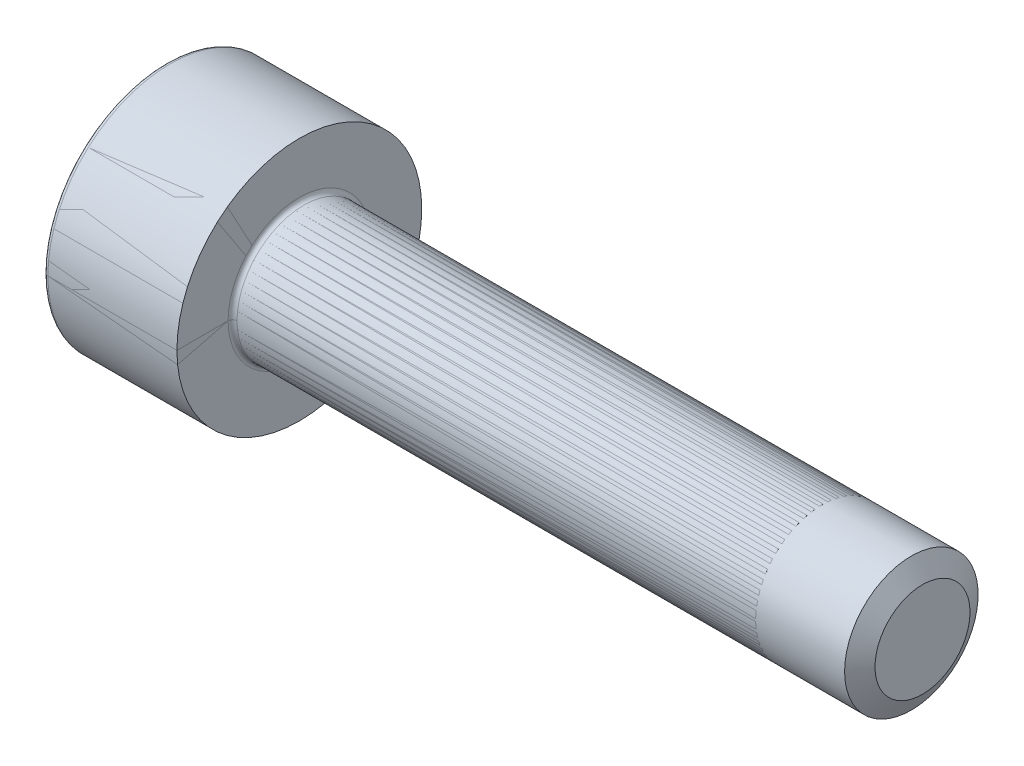
ISO-10303-21;
HEADER;
FILE_DESCRIPTION(('STEP AP214'),'2;1');
FILE_NAME('part.step','',(''),(''),'','','');
FILE_SCHEMA(('AUTOMOTIVE_DESIGN { 1 0 10303 214 1 1 1 1 }'));
ENDSEC;
DATA;
#1=APPLICATION_CONTEXT('core data for automotive mechanical design processes');
#2=APPLICATION_PROTOCOL_DEFINITION('international standard','automotive_design',2000,#1);
#3=PRODUCT_CONTEXT('',#1,'mechanical');
#4=PRODUCT('Part','Part','',(#3));
#5=PRODUCT_RELATED_PRODUCT_CATEGORY('part','',(#4));
#6=PRODUCT_DEFINITION_FORMATION('','',#4);
#7=PRODUCT_DEFINITION_CONTEXT('part definition',#1,'design');
#8=PRODUCT_DEFINITION('design','',#6,#7);
#9=PRODUCT_DEFINITION_SHAPE('','',#8);
#10=(LENGTH_UNIT() NAMED_UNIT(*) SI_UNIT(.MILLI.,.METRE.));
#11=(NAMED_UNIT(*) PLANE_ANGLE_UNIT() SI_UNIT($,.RADIAN.));
#12=(NAMED_UNIT(*) SI_UNIT($,.STERADIAN.) SOLID_ANGLE_UNIT());
#13=UNCERTAINTY_MEASURE_WITH_UNIT(LENGTH_MEASURE(1.E-05),#10,'distance_accuracy_value','');
#14=(GEOMETRIC_REPRESENTATION_CONTEXT(3) GLOBAL_UNCERTAINTY_ASSIGNED_CONTEXT((#13)) GLOBAL_UNIT_ASSIGNED_CONTEXT((#10,
#11,#12)) REPRESENTATION_CONTEXT('',''));
#15=CARTESIAN_POINT('',(0.,0.,0.));
#16=DIRECTION('',(0.,0.,1.));
#17=DIRECTION('',(1.,0.,0.));
#18=AXIS2_PLACEMENT_3D('',#15,#16,#17);
#19=CARTESIAN_POINT('',(0.1,0.,0.));
#20=DIRECTION('',(-1.,0.,0.));
#21=DIRECTION('',(0.,0.,1.));
#22=AXIS2_PLACEMENT_3D('',#19,#20,#21);
#23=TOROIDAL_SURFACE('',#22,2.65,0.1);
#24=CARTESIAN_POINT('',(0.1,0.,-2.65));
#25=DIRECTION('',(0.,1.,0.));
#26=DIRECTION('',(0.,0.,1.));
#27=AXIS2_PLACEMENT_3D('',#24,#25,#26);
#28=CIRCLE('',#27,0.1);
#29=CARTESIAN_POINT('',(0.1,0.,-2.75));
#30=VERTEX_POINT('',#29);
#31=CARTESIAN_POINT('',(0.,0.,-2.65));
#32=VERTEX_POINT('',#31);
#33=EDGE_CURVE('P0_E199',#30,#32,#28,.T.);
#34=ORIENTED_EDGE('',*,*,#33,.F.);
#35=CARTESIAN_POINT('',(0.1,0.,0.));
#36=DIRECTION('',(1.,0.,0.));
#37=DIRECTION('',(0.,0.,1.));
#38=AXIS2_PLACEMENT_3D('',#35,#36,#37);
#39=CIRCLE('',#38,2.75);
#40=CARTESIAN_POINT('',(0.1,0.,2.75));
#41=VERTEX_POINT('',#40);
#42=EDGE_CURVE('P0_E203',#41,#30,#39,.T.);
#43=ORIENTED_EDGE('',*,*,#42,.F.);
#44=CARTESIAN_POINT('',(0.1,0.,2.65));
#45=DIRECTION('',(0.,-1.,0.));
#46=DIRECTION('',(0.,0.,-1.));
#47=AXIS2_PLACEMENT_3D('',#44,#45,#46);
#48=CIRCLE('',#47,0.1);
#49=CARTESIAN_POINT('',(0.,0.,2.65));
#50=VERTEX_POINT('',#49);
#51=EDGE_CURVE('P0_E195',#41,#50,#48,.T.);
#52=ORIENTED_EDGE('',*,*,#51,.T.);
#53=CARTESIAN_POINT('',(0.,0.,0.));
#54=DIRECTION('',(-1.,0.,0.));
#55=DIRECTION('',(0.,0.,1.));
#56=AXIS2_PLACEMENT_3D('',#53,#54,#55);
#57=CIRCLE('',#56,2.65);
#58=EDGE_CURVE('P0_E221',#32,#50,#57,.T.);
#59=ORIENTED_EDGE('',*,*,#58,.F.);
#60=EDGE_LOOP('',(#34,#43,#52,#59));
#61=FACE_BOUND('',#60,.T.);
#62=ADVANCED_FACE('P0_F36',(#61),#23,.T.);
#63=CARTESIAN_POINT('',(1.3,-0.7175,1.24274645443067));
#64=DIRECTION('',(-1.,0.,0.));
#65=DIRECTION('',(0.,0.,1.));
#66=AXIS2_PLACEMENT_3D('',#63,#64,#65);
#67=PLANE('',#66);
#68=DIRECTION('',(0.,0.5,0.866025403784439));
#69=VECTOR('',#68,1.);
#70=CARTESIAN_POINT('',(1.3,-1.435,0.));
#71=LINE('',#70,#69);
#72=CARTESIAN_POINT('',(1.3,-1.435,0.));
#73=VERTEX_POINT('',#72);
#74=CARTESIAN_POINT('',(1.3,-0.7175,1.24274645443067));
#75=VERTEX_POINT('',#74);
#76=EDGE_CURVE('P0_E142',#73,#75,#71,.T.);
#77=ORIENTED_EDGE('',*,*,#76,.T.);
#78=DIRECTION('',(0.,1.,0.));
#79=VECTOR('',#78,1.);
#80=CARTESIAN_POINT('',(1.3,-0.7175,1.24274645443067));
#81=LINE('',#80,#79);
#82=CARTESIAN_POINT('',(1.3,0.7175,1.24274645443067));
#83=VERTEX_POINT('',#82);
#84=EDGE_CURVE('P0_E11',#75,#83,#81,.T.);
#85=ORIENTED_EDGE('',*,*,#84,.T.);
#86=DIRECTION('',(0.,0.5,-0.866025403784439));
#87=VECTOR('',#86,1.);
#88=CARTESIAN_POINT('',(1.3,0.7175,1.24274645443067));
#89=LINE('',#88,#87);
#90=CARTESIAN_POINT('',(1.3,1.435,0.));
#91=VERTEX_POINT('',#90);
#92=EDGE_CURVE('P0_E258',#83,#91,#89,.T.);
#93=ORIENTED_EDGE('',*,*,#92,.T.);
#94=DIRECTION('',(0.,-0.5,-0.866025403784439));
#95=VECTOR('',#94,1.);
#96=CARTESIAN_POINT('',(1.3,1.435,0.));
#97=LINE('',#96,#95);
#98=CARTESIAN_POINT('',(1.3,0.7175,-1.24274645443067));
#99=VERTEX_POINT('',#98);
#100=EDGE_CURVE('P0_E250',#91,#99,#97,.T.);
#101=ORIENTED_EDGE('',*,*,#100,.T.);
#102=DIRECTION('',(0.,-1.,0.));
#103=VECTOR('',#102,1.);
#104=CARTESIAN_POINT('',(1.3,0.7175,-1.24274645443067));
#105=LINE('',#104,#103);
#106=CARTESIAN_POINT('',(1.3,-0.7175,-1.24274645443067));
#107=VERTEX_POINT('',#106);
#108=EDGE_CURVE('P0_E254',#99,#107,#105,.T.);
#109=ORIENTED_EDGE('',*,*,#108,.T.);
#110=DIRECTION('',(0.,-0.5,0.866025403784439));
#111=VECTOR('',#110,1.);
#112=CARTESIAN_POINT('',(1.3,-0.7175,-1.24274645443067));
#113=LINE('',#112,#111);
#114=EDGE_CURVE('P0_E145',#107,#73,#113,.T.);
#115=ORIENTED_EDGE('',*,*,#114,.T.);
#116=EDGE_LOOP('',(#77,#85,#93,#101,#109,#115));
#117=FACE_BOUND('',#116,.T.);
#118=ADVANCED_FACE('P0_F143',(#117),#67,.T.);
#119=CARTESIAN_POINT('',(1.3,-0.7175,1.24274645443067));
#120=DIRECTION('',(0.,0.,1.));
#121=DIRECTION('',(0.,-1.,0.));
#122=AXIS2_PLACEMENT_3D('',#119,#120,#121);
#123=PLANE('',#122);
#124=DIRECTION('',(0.,1.,0.));
#125=VECTOR('',#124,1.);
#126=CARTESIAN_POINT('',(0.,-0.7175,1.24274645443067));
#127=LINE('',#126,#125);
#128=CARTESIAN_POINT('',(0.,-0.7175,1.24274645443067));
#129=VERTEX_POINT('',#128);
#130=CARTESIAN_POINT('',(0.,0.7175,1.24274645443067));
#131=VERTEX_POINT('',#130);
#132=EDGE_CURVE('P0_E209',#129,#131,#127,.T.);
#133=ORIENTED_EDGE('',*,*,#132,.T.);
#134=DIRECTION('',(-1.,0.,0.));
#135=VECTOR('',#134,1.);
#136=CARTESIAN_POINT('',(1.3,0.7175,1.24274645443067));
#137=LINE('',#136,#135);
#138=EDGE_CURVE('P0_E47',#83,#131,#137,.T.);
#139=ORIENTED_EDGE('',*,*,#138,.F.);
#140=ORIENTED_EDGE('',*,*,#84,.F.);
#141=DIRECTION('',(-1.,0.,0.));
#142=VECTOR('',#141,1.);
#143=CARTESIAN_POINT('',(1.3,-0.7175,1.24274645443067));
#144=LINE('',#143,#142);
#145=EDGE_CURVE('P0_E139',#75,#129,#144,.T.);
#146=ORIENTED_EDGE('',*,*,#145,.T.);
#147=EDGE_LOOP('',(#133,#139,#140,#146));
#148=FACE_BOUND('',#147,.T.);
#149=ADVANCED_FACE('P0_F38',(#148),#123,.F.);
#150=CARTESIAN_POINT('',(1.3,0.7175,1.24274645443067));
#151=DIRECTION('',(0.,0.866025403784439,0.5));
#152=DIRECTION('',(1.,0.,0.));
#153=AXIS2_PLACEMENT_3D('',#150,#151,#152);
#154=PLANE('',#153);
#155=DIRECTION('',(0.,0.5,-0.866025403784439));
#156=VECTOR('',#155,1.);
#157=CARTESIAN_POINT('',(0.,0.7175,1.24274645443067));
#158=LINE('',#157,#156);
#159=CARTESIAN_POINT('',(0.,1.435,0.));
#160=VERTEX_POINT('',#159);
#161=EDGE_CURVE('P0_E218',#131,#160,#158,.T.);
#162=ORIENTED_EDGE('',*,*,#161,.T.);
#163=DIRECTION('',(-1.,0.,0.));
#164=VECTOR('',#163,1.);
#165=CARTESIAN_POINT('',(1.3,1.435,0.));
#166=LINE('',#165,#164);
#167=EDGE_CURVE('P0_E255',#91,#160,#166,.T.);
#168=ORIENTED_EDGE('',*,*,#167,.F.);
#169=ORIENTED_EDGE('',*,*,#92,.F.);
#170=ORIENTED_EDGE('',*,*,#138,.T.);
#171=EDGE_LOOP('',(#162,#168,#169,#170));
#172=FACE_BOUND('',#171,.T.);
#173=ADVANCED_FACE('P0_F375',(#172),#154,.F.);
#174=CARTESIAN_POINT('',(1.3,1.435,0.));
#175=DIRECTION('',(0.,0.866025403784439,-0.5));
#176=DIRECTION('',(-1.,0.,0.));
#177=AXIS2_PLACEMENT_3D('',#174,#175,#176);
#178=PLANE('',#177);
#179=DIRECTION('',(0.,-0.5,-0.866025403784439));
#180=VECTOR('',#179,1.);
#181=CARTESIAN_POINT('',(0.,1.435,0.));
#182=LINE('',#181,#180);
#183=CARTESIAN_POINT('',(0.,0.7175,-1.24274645443067));
#184=VERTEX_POINT('',#183);
#185=EDGE_CURVE('P0_E271',#160,#184,#182,.T.);
#186=ORIENTED_EDGE('',*,*,#185,.T.);
#187=DIRECTION('',(-1.,0.,0.));
#188=VECTOR('',#187,1.);
#189=CARTESIAN_POINT('',(1.3,0.7175,-1.24274645443067));
#190=LINE('',#189,#188);
#191=EDGE_CURVE('P0_E252',#99,#184,#190,.T.);
#192=ORIENTED_EDGE('',*,*,#191,.F.);
#193=ORIENTED_EDGE('',*,*,#100,.F.);
#194=ORIENTED_EDGE('',*,*,#167,.T.);
#195=EDGE_LOOP('',(#186,#192,#193,#194));
#196=FACE_BOUND('',#195,.T.);
#197=ADVANCED_FACE('P0_F377',(#196),#178,.F.);
#198=CARTESIAN_POINT('',(1.3,0.7175,-1.24274645443067));
#199=DIRECTION('',(0.,0.,-1.));
#200=DIRECTION('',(0.,-1.,0.));
#201=AXIS2_PLACEMENT_3D('',#198,#199,#200);
#202=PLANE('',#201);
#203=DIRECTION('',(0.,-1.,0.));
#204=VECTOR('',#203,1.);
#205=CARTESIAN_POINT('',(0.,0.7175,-1.24274645443067));
#206=LINE('',#205,#204);
#207=CARTESIAN_POINT('',(0.,-0.7175,-1.24274645443067));
#208=VERTEX_POINT('',#207);
#209=EDGE_CURVE('P0_E274',#184,#208,#206,.T.);
#210=ORIENTED_EDGE('',*,*,#209,.T.);
#211=DIRECTION('',(-1.,0.,0.));
#212=VECTOR('',#211,1.);
#213=CARTESIAN_POINT('',(1.3,-0.7175,-1.24274645443067));
#214=LINE('',#213,#212);
#215=EDGE_CURVE('P0_E169',#107,#208,#214,.T.);
#216=ORIENTED_EDGE('',*,*,#215,.F.);
#217=ORIENTED_EDGE('',*,*,#108,.F.);
#218=ORIENTED_EDGE('',*,*,#191,.T.);
#219=EDGE_LOOP('',(#210,#216,#217,#218));
#220=FACE_BOUND('',#219,.T.);
#221=ADVANCED_FACE('P0_F382',(#220),#202,.F.);
#222=CARTESIAN_POINT('',(1.3,-0.7175,-1.24274645443067));
#223=DIRECTION('',(0.,-0.866025403784439,-0.5));
#224=DIRECTION('',(0.,0.5,-0.866025403784439));
#225=AXIS2_PLACEMENT_3D('',#222,#223,#224);
#226=PLANE('',#225);
#227=DIRECTION('',(0.,-0.5,0.866025403784439));
#228=VECTOR('',#227,1.);
#229=CARTESIAN_POINT('',(0.,-0.7175,-1.24274645443067));
#230=LINE('',#229,#228);
#231=CARTESIAN_POINT('',(0.,-1.435,0.));
#232=VERTEX_POINT('',#231);
#233=EDGE_CURVE('P0_E40',#208,#232,#230,.T.);
#234=ORIENTED_EDGE('',*,*,#233,.T.);
#235=DIRECTION('',(-1.,0.,0.));
#236=VECTOR('',#235,1.);
#237=CARTESIAN_POINT('',(1.3,-1.435,0.));
#238=LINE('',#237,#236);
#239=EDGE_CURVE('P0_E150',#73,#232,#238,.T.);
#240=ORIENTED_EDGE('',*,*,#239,.F.);
#241=ORIENTED_EDGE('',*,*,#114,.F.);
#242=ORIENTED_EDGE('',*,*,#215,.T.);
#243=EDGE_LOOP('',(#234,#240,#241,#242));
#244=FACE_BOUND('',#243,.T.);
#245=ADVANCED_FACE('P0_F348',(#244),#226,.F.);
#246=CARTESIAN_POINT('',(1.3,-1.435,0.));
#247=DIRECTION('',(0.,-0.866025403784439,0.5));
#248=DIRECTION('',(-1.,0.,0.));
#249=AXIS2_PLACEMENT_3D('',#246,#247,#248);
#250=PLANE('',#249);
#251=DIRECTION('',(0.,0.5,0.866025403784439));
#252=VECTOR('',#251,1.);
#253=CARTESIAN_POINT('',(0.,-1.435,0.));
#254=LINE('',#253,#252);
#255=EDGE_CURVE('P0_E155',#232,#129,#254,.T.);
#256=ORIENTED_EDGE('',*,*,#255,.T.);
#257=ORIENTED_EDGE('',*,*,#145,.F.);
#258=ORIENTED_EDGE('',*,*,#76,.F.);
#259=ORIENTED_EDGE('',*,*,#239,.T.);
#260=EDGE_LOOP('',(#256,#257,#258,#259));
#261=FACE_BOUND('',#260,.T.);
#262=ADVANCED_FACE('P0_F153',(#261),#250,.F.);
#263=CARTESIAN_POINT('',(3.1,0.,0.));
#264=DIRECTION('',(1.,0.,0.));
#265=DIRECTION('',(0.,0.,-1.));
#266=AXIS2_PLACEMENT_3D('',#263,#264,#265);
#267=TOROIDAL_SURFACE('',#266,1.6,0.1);
#268=CARTESIAN_POINT('',(3.1,0.,1.6));
#269=DIRECTION('',(0.,1.,0.));
#270=DIRECTION('',(0.,0.,1.));
#271=AXIS2_PLACEMENT_3D('',#268,#269,#270);
#272=CIRCLE('',#271,0.1);
#273=CARTESIAN_POINT('',(3.1,0.,1.5));
#274=VERTEX_POINT('',#273);
#275=CARTESIAN_POINT('',(3.,0.,1.6));
#276=VERTEX_POINT('',#275);
#277=EDGE_CURVE('P0_E174',#274,#276,#272,.T.);
#278=ORIENTED_EDGE('',*,*,#277,.F.);
#279=CARTESIAN_POINT('',(3.1,0.,0.));
#280=DIRECTION('',(1.,0.,0.));
#281=DIRECTION('',(0.,0.,-1.));
#282=AXIS2_PLACEMENT_3D('',#279,#280,#281);
#283=CIRCLE('',#282,1.5);
#284=CARTESIAN_POINT('',(3.1,0.,-1.5));
#285=VERTEX_POINT('',#284);
#286=EDGE_CURVE('P0_E270',#285,#274,#283,.T.);
#287=ORIENTED_EDGE('',*,*,#286,.F.);
#288=CARTESIAN_POINT('',(3.1,0.,-1.6));
#289=DIRECTION('',(0.,-1.,0.));
#290=DIRECTION('',(0.,0.,-1.));
#291=AXIS2_PLACEMENT_3D('',#288,#289,#290);
#292=CIRCLE('',#291,0.1);
#293=CARTESIAN_POINT('',(3.,0.,-1.6));
#294=VERTEX_POINT('',#293);
#295=EDGE_CURVE('P0_E173',#285,#294,#292,.T.);
#296=ORIENTED_EDGE('',*,*,#295,.T.);
#297=CARTESIAN_POINT('',(3.,0.,0.));
#298=DIRECTION('',(1.,0.,0.));
#299=DIRECTION('',(0.,0.,-1.));
#300=AXIS2_PLACEMENT_3D('',#297,#298,#299);
#301=CIRCLE('',#300,1.6);
#302=EDGE_CURVE('P0_E157',#294,#276,#301,.T.);
#303=ORIENTED_EDGE('',*,*,#302,.T.);
#304=EDGE_LOOP('',(#278,#287,#296,#303));
#305=FACE_BOUND('',#304,.T.);
#306=ADVANCED_FACE('P0_F360',(#305),#267,.F.);
#307=CARTESIAN_POINT('',(3.,2.75,0.));
#308=DIRECTION('',(1.,0.,0.));
#309=DIRECTION('',(0.,1.,0.));
#310=AXIS2_PLACEMENT_3D('',#307,#308,#309);
#311=PLANE('',#310);
#312=ORIENTED_EDGE('',*,*,#302,.F.);
#313=CARTESIAN_POINT('',(3.,0.,0.));
#314=DIRECTION('',(1.,0.,0.));
#315=DIRECTION('',(0.,0.,-1.));
#316=AXIS2_PLACEMENT_3D('',#313,#314,#315);
#317=CIRCLE('',#316,1.6);
#318=EDGE_CURVE('P0_E170',#276,#294,#317,.T.);
#319=ORIENTED_EDGE('',*,*,#318,.F.);
#320=EDGE_LOOP('',(#312,#319));
#321=FACE_BOUND('',#320,.T.);
#322=CARTESIAN_POINT('',(3.,0.,0.));
#323=DIRECTION('',(1.,0.,0.));
#324=DIRECTION('',(0.,0.,-1.));
#325=AXIS2_PLACEMENT_3D('',#322,#323,#324);
#326=CIRCLE('',#325,2.75);
#327=CARTESIAN_POINT('',(3.,0.,-2.75));
#328=VERTEX_POINT('',#327);
#329=CARTESIAN_POINT('',(3.,0.,2.75));
#330=VERTEX_POINT('',#329);
#331=EDGE_CURVE('P0_E167',#328,#330,#326,.T.);
#332=ORIENTED_EDGE('',*,*,#331,.T.);
#333=CARTESIAN_POINT('',(3.,0.,0.));
#334=DIRECTION('',(1.,0.,0.));
#335=DIRECTION('',(0.,0.,-1.));
#336=AXIS2_PLACEMENT_3D('',#333,#334,#335);
#337=CIRCLE('',#336,2.75);
#338=EDGE_CURVE('P0_E163',#330,#328,#337,.T.);
#339=ORIENTED_EDGE('',*,*,#338,.T.);
#340=EDGE_LOOP('',(#332,#339));
#341=FACE_BOUND('',#340,.T.);
#342=ADVANCED_FACE('P0_F288',(#321,#341),#311,.T.);
#343=CARTESIAN_POINT('',(0.,0.,0.));
#344=DIRECTION('',(1.,0.,0.));
#345=DIRECTION('',(0.,0.,-1.));
#346=AXIS2_PLACEMENT_3D('',#343,#344,#345);
#347=CYLINDRICAL_SURFACE('',#346,2.75);
#348=DIRECTION('',(1.,0.,0.));
#349=VECTOR('',#348,1.);
#350=CARTESIAN_POINT('',(0.,0.,2.75));
#351=LINE('',#350,#349);
#352=EDGE_CURVE('P0_E183',#41,#330,#351,.T.);
#353=ORIENTED_EDGE('',*,*,#352,.F.);
#354=ORIENTED_EDGE('',*,*,#42,.T.);
#355=DIRECTION('',(1.,0.,0.));
#356=VECTOR('',#355,1.);
#357=CARTESIAN_POINT('',(0.,0.,-2.75));
#358=LINE('',#357,#356);
#359=EDGE_CURVE('P0_E282',#30,#328,#358,.T.);
#360=ORIENTED_EDGE('',*,*,#359,.T.);
#361=ORIENTED_EDGE('',*,*,#338,.F.);
#362=EDGE_LOOP('',(#353,#354,#360,#361));
#363=FACE_BOUND('',#362,.T.);
#364=ADVANCED_FACE('P0_F291',(#363),#347,.T.);
#365=CARTESIAN_POINT('',(0.,0.,0.));
#366=DIRECTION('',(-1.,0.,0.));
#367=DIRECTION('',(0.,0.,1.));
#368=AXIS2_PLACEMENT_3D('',#365,#366,#367);
#369=PLANE('',#368);
#370=ORIENTED_EDGE('',*,*,#255,.F.);
#371=ORIENTED_EDGE('',*,*,#233,.F.);
#372=ORIENTED_EDGE('',*,*,#209,.F.);
#373=ORIENTED_EDGE('',*,*,#185,.F.);
#374=ORIENTED_EDGE('',*,*,#161,.F.);
#375=ORIENTED_EDGE('',*,*,#132,.F.);
#376=EDGE_LOOP('',(#370,#371,#372,#373,#374,#375));
#377=FACE_BOUND('',#376,.T.);
#378=CARTESIAN_POINT('',(0.,0.,0.));
#379=DIRECTION('',(-1.,0.,0.));
#380=DIRECTION('',(0.,0.,1.));
#381=AXIS2_PLACEMENT_3D('',#378,#379,#380);
#382=CIRCLE('',#381,2.65);
#383=EDGE_CURVE('P0_E222',#50,#32,#382,.T.);
#384=ORIENTED_EDGE('',*,*,#383,.T.);
#385=ORIENTED_EDGE('',*,*,#58,.T.);
#386=EDGE_LOOP('',(#384,#385));
#387=FACE_BOUND('',#386,.T.);
#388=ADVANCED_FACE('P0_F296',(#377,#387),#369,.T.);
#389=CARTESIAN_POINT('',(0.,0.,0.));
#390=DIRECTION('',(1.,0.,0.));
#391=DIRECTION('',(0.,0.,-1.));
#392=AXIS2_PLACEMENT_3D('',#389,#390,#391);
#393=CYLINDRICAL_SURFACE('',#392,1.5);
#394=ORIENTED_EDGE('',*,*,#286,.T.);
#395=DIRECTION('',(1.,0.,0.));
#396=VECTOR('',#395,1.);
#397=CARTESIAN_POINT('',(0.,0.,1.5));
#398=LINE('',#397,#396);
#399=CARTESIAN_POINT('',(14.75,0.,1.5));
#400=VERTEX_POINT('',#399);
#401=EDGE_CURVE('P0_E266',#274,#400,#398,.T.);
#402=ORIENTED_EDGE('',*,*,#401,.T.);
#403=ORIENTED_EDGE('',*,*,#401,.F.);
#404=CARTESIAN_POINT('',(3.1,0.,0.));
#405=DIRECTION('',(1.,0.,0.));
#406=DIRECTION('',(0.,0.,-1.));
#407=AXIS2_PLACEMENT_3D('',#404,#405,#406);
#408=CIRCLE('',#407,1.5);
#409=EDGE_CURVE('P0_E186',#274,#285,#408,.T.);
#410=ORIENTED_EDGE('',*,*,#409,.T.);
#411=DIRECTION('',(1.,0.,0.));
#412=VECTOR('',#411,1.);
#413=CARTESIAN_POINT('',(0.,0.,-1.5));
#414=LINE('',#413,#412);
#415=CARTESIAN_POINT('',(14.75,0.,-1.5));
#416=VERTEX_POINT('',#415);
#417=EDGE_CURVE('P0_E265',#285,#416,#414,.T.);
#418=ORIENTED_EDGE('',*,*,#417,.T.);
#419=ORIENTED_EDGE('',*,*,#417,.F.);
#420=EDGE_LOOP('',(#394,#402,#403,#410,#418,#419));
#421=FACE_BOUND('',#420,.T.);
#422=CARTESIAN_POINT('',(16.75,0.,0.));
#423=DIRECTION('',(-1.,0.,0.));
#424=DIRECTION('',(0.,0.,1.));
#425=AXIS2_PLACEMENT_3D('',#422,#423,#424);
#426=CIRCLE('',#425,1.5);
#427=CARTESIAN_POINT('',(16.75,0.,1.5));
#428=VERTEX_POINT('',#427);
#429=EDGE_CURVE('P0_E246',#428,#428,#426,.T.);
#430=ORIENTED_EDGE('',*,*,#429,.T.);
#431=EDGE_LOOP('',(#430));
#432=FACE_BOUND('',#431,.T.);
#433=ADVANCED_FACE('P0_F298',(#421,#432),#393,.T.);
#434=CARTESIAN_POINT('',(0.,0.,0.));
#435=DIRECTION('',(1.,0.,0.));
#436=DIRECTION('',(0.,0.,-1.));
#437=AXIS2_PLACEMENT_3D('',#434,#435,#436);
#438=CYLINDRICAL_SURFACE('',#437,2.75);
#439=CARTESIAN_POINT('',(0.1,0.,0.));
#440=DIRECTION('',(1.,0.,0.));
#441=DIRECTION('',(0.,0.,1.));
#442=AXIS2_PLACEMENT_3D('',#439,#440,#441);
#443=CIRCLE('',#442,2.75);
#444=EDGE_CURVE('P0_E232',#30,#41,#443,.T.);
#445=ORIENTED_EDGE('',*,*,#444,.T.);
#446=ORIENTED_EDGE('',*,*,#352,.T.);
#447=ORIENTED_EDGE('',*,*,#331,.F.);
#448=ORIENTED_EDGE('',*,*,#359,.F.);
#449=EDGE_LOOP('',(#445,#446,#447,#448));
#450=FACE_BOUND('',#449,.T.);
#451=ADVANCED_FACE('P0_F289',(#450),#438,.T.);
#452=CARTESIAN_POINT('',(3.1,0.,0.));
#453=DIRECTION('',(1.,0.,0.));
#454=DIRECTION('',(0.,0.,-1.));
#455=AXIS2_PLACEMENT_3D('',#452,#453,#454);
#456=TOROIDAL_SURFACE('',#455,1.6,0.1);
#457=ORIENTED_EDGE('',*,*,#409,.F.);
#458=ORIENTED_EDGE('',*,*,#277,.T.);
#459=ORIENTED_EDGE('',*,*,#318,.T.);
#460=ORIENTED_EDGE('',*,*,#295,.F.);
#461=EDGE_LOOP('',(#457,#458,#459,#460));
#462=FACE_BOUND('',#461,.T.);
#463=ADVANCED_FACE('P0_F362',(#462),#456,.F.);
#464=CARTESIAN_POINT('',(0.1,0.,0.));
#465=DIRECTION('',(-1.,0.,0.));
#466=DIRECTION('',(0.,0.,1.));
#467=AXIS2_PLACEMENT_3D('',#464,#465,#466);
#468=TOROIDAL_SURFACE('',#467,2.65,0.1);
#469=ORIENTED_EDGE('',*,*,#444,.F.);
#470=ORIENTED_EDGE('',*,*,#33,.T.);
#471=ORIENTED_EDGE('',*,*,#383,.F.);
#472=ORIENTED_EDGE('',*,*,#51,.F.);
#473=EDGE_LOOP('',(#469,#470,#471,#472));
#474=FACE_BOUND('',#473,.T.);
#475=ADVANCED_FACE('P0_F294',(#474),#468,.T.);
#476=CARTESIAN_POINT('',(17.,0.,0.));
#477=DIRECTION('',(-1.,0.,0.));
#478=DIRECTION('',(0.,0.,1.));
#479=AXIS2_PLACEMENT_3D('',#476,#477,#478);
#480=PLANE('',#479);
#481=CARTESIAN_POINT('',(17.,0.,0.));
#482=DIRECTION('',(-1.,0.,0.));
#483=DIRECTION('',(0.,0.,1.));
#484=AXIS2_PLACEMENT_3D('',#481,#482,#483);
#485=CIRCLE('',#484,1.067);
#486=CARTESIAN_POINT('',(17.,0.,1.067));
#487=VERTEX_POINT('',#486);
#488=EDGE_CURVE('P0_E239',#487,#487,#485,.T.);
#489=ORIENTED_EDGE('',*,*,#488,.F.);
#490=EDGE_LOOP('',(#489));
#491=FACE_BOUND('',#490,.T.);
#492=ADVANCED_FACE('P0_F316',(#491),#480,.F.);
#493=CARTESIAN_POINT('',(17.,0.,0.));
#494=DIRECTION('',(-1.,0.,0.));
#495=DIRECTION('',(0.,0.,1.));
#496=AXIS2_PLACEMENT_3D('',#493,#494,#495);
#497=CONICAL_SURFACE('',#496,1.067,1.04718484902493);
#498=ORIENTED_EDGE('',*,*,#429,.F.);
#499=EDGE_LOOP('',(#498));
#500=FACE_BOUND('',#499,.T.);
#501=ORIENTED_EDGE('',*,*,#488,.T.);
#502=EDGE_LOOP('',(#501));
#503=FACE_BOUND('',#502,.T.);
#504=ADVANCED_FACE('P0_F319',(#500,#503),#497,.T.);
#505=CLOSED_SHELL('',(#62,#118,#149,#173,#197,#221,#245,#262,#306,#342,#364,#388,#433,#451,#463,
#475,#492,#504));
#506=MANIFOLD_SOLID_BREP('P0_B2',#505);
#507=CARTESIAN_POINT('',(15.,1.5,0.));
#508=DIRECTION('',(1.,0.,0.));
#509=DIRECTION('',(0.,1.,0.));
#510=AXIS2_PLACEMENT_3D('',#507,#508,#509);
#511=PLANE('',#510);
#512=CARTESIAN_POINT('',(15.,0.,0.));
#513=DIRECTION('',(-1.,0.,0.));
#514=DIRECTION('',(0.,0.,1.));
#515=AXIS2_PLACEMENT_3D('',#512,#513,#514);
#516=CIRCLE('',#515,1.067);
#517=CARTESIAN_POINT('',(15.,0.,1.067));
#518=VERTEX_POINT('',#517);
#519=CARTESIAN_POINT('',(15.,0.,-1.067));
#520=VERTEX_POINT('',#519);
#521=EDGE_CURVE('P1_E218',#518,#520,#516,.T.);
#522=ORIENTED_EDGE('',*,*,#521,.F.);
#523=CARTESIAN_POINT('',(15.,0.,0.));
#524=DIRECTION('',(-1.,0.,0.));
#525=DIRECTION('',(0.,0.,1.));
#526=AXIS2_PLACEMENT_3D('',#523,#524,#525);
#527=CIRCLE('',#526,1.067);
#528=EDGE_CURVE('P1_E11',#520,#518,#527,.T.);
#529=ORIENTED_EDGE('',*,*,#528,.F.);
#530=EDGE_LOOP('',(#522,#529));
#531=FACE_BOUND('',#530,.T.);
#532=ADVANCED_FACE('P1_F16',(#531),#511,.T.);
#533=CARTESIAN_POINT('',(14.75,0.,0.));
#534=DIRECTION('',(-1.,0.,0.));
#535=DIRECTION('',(0.,0.,1.));
#536=AXIS2_PLACEMENT_3D('',#533,#534,#535);
#537=CONICAL_SURFACE('',#536,1.5,1.04718484902493);
#538=DIRECTION('',(-0.500011000363013,0.,-0.866019052628739));
#539=VECTOR('',#538,1.);
#540=CARTESIAN_POINT('',(14.75,0.,-1.5));
#541=LINE('',#540,#539);
#542=CARTESIAN_POINT('',(14.75,0.,-1.5));
#543=VERTEX_POINT('',#542);
#544=EDGE_CURVE('P1_E199',#520,#543,#541,.T.);
#545=ORIENTED_EDGE('',*,*,#544,.F.);
#546=ORIENTED_EDGE('',*,*,#528,.T.);
#547=DIRECTION('',(-0.500011000363013,0.,0.866019052628739));
#548=VECTOR('',#547,1.);
#549=CARTESIAN_POINT('',(14.75,0.,1.5));
#550=LINE('',#549,#548);
#551=CARTESIAN_POINT('',(14.75,0.,1.5));
#552=VERTEX_POINT('',#551);
#553=EDGE_CURVE('P1_E198',#518,#552,#550,.T.);
#554=ORIENTED_EDGE('',*,*,#553,.T.);
#555=CARTESIAN_POINT('',(14.75,0.,0.));
#556=DIRECTION('',(-1.,0.,0.));
#557=DIRECTION('',(0.,0.,1.));
#558=AXIS2_PLACEMENT_3D('',#555,#556,#557);
#559=CIRCLE('',#558,1.5);
#560=EDGE_CURVE('P1_E247',#543,#552,#559,.T.);
#561=ORIENTED_EDGE('',*,*,#560,.F.);
#562=EDGE_LOOP('',(#545,#546,#554,#561));
#563=FACE_BOUND('',#562,.T.);
#564=ADVANCED_FACE('P1_F294',(#563),#537,.T.);
#565=CARTESIAN_POINT('',(0.1,0.,0.));
#566=DIRECTION('',(-1.,0.,0.));
#567=DIRECTION('',(0.,0.,1.));
#568=AXIS2_PLACEMENT_3D('',#565,#566,#567);
#569=TOROIDAL_SURFACE('',#568,2.65,0.1);
#570=CARTESIAN_POINT('',(0.1,0.,-2.65));
#571=DIRECTION('',(0.,1.,0.));
#572=DIRECTION('',(0.,0.,1.));
#573=AXIS2_PLACEMENT_3D('',#570,#571,#572);
#574=CIRCLE('',#573,0.1);
#575=CARTESIAN_POINT('',(0.1,0.,-2.75));
#576=VERTEX_POINT('',#575);
#577=CARTESIAN_POINT('',(0.,0.,-2.65));
#578=VERTEX_POINT('',#577);
#579=EDGE_CURVE('P1_E179',#576,#578,#574,.T.);
#580=ORIENTED_EDGE('',*,*,#579,.F.);
#581=CARTESIAN_POINT('',(0.1,0.,0.));
#582=DIRECTION('',(1.,0.,0.));
#583=DIRECTION('',(0.,0.,1.));
#584=AXIS2_PLACEMENT_3D('',#581,#582,#583);
#585=CIRCLE('',#584,2.75);
#586=CARTESIAN_POINT('',(0.1,0.,2.75));
#587=VERTEX_POINT('',#586);
#588=EDGE_CURVE('P1_E175',#587,#576,#585,.T.);
#589=ORIENTED_EDGE('',*,*,#588,.F.);
#590=CARTESIAN_POINT('',(0.1,0.,2.65));
#591=DIRECTION('',(0.,-1.,0.));
#592=DIRECTION('',(0.,0.,-1.));
#593=AXIS2_PLACEMENT_3D('',#590,#591,#592);
#594=CIRCLE('',#593,0.1);
#595=CARTESIAN_POINT('',(0.,0.,2.65));
#596=VERTEX_POINT('',#595);
#597=EDGE_CURVE('P1_E188',#587,#596,#594,.T.);
#598=ORIENTED_EDGE('',*,*,#597,.T.);
#599=CARTESIAN_POINT('',(0.,0.,0.));
#600=DIRECTION('',(-1.,0.,0.));
#601=DIRECTION('',(0.,0.,1.));
#602=AXIS2_PLACEMENT_3D('',#599,#600,#601);
#603=CIRCLE('',#602,2.65);
#604=EDGE_CURVE('P1_E204',#578,#596,#603,.T.);
#605=ORIENTED_EDGE('',*,*,#604,.F.);
#606=EDGE_LOOP('',(#580,#589,#598,#605));
#607=FACE_BOUND('',#606,.T.);
#608=ADVANCED_FACE('P1_F503',(#607),#569,.T.);
#609=CARTESIAN_POINT('',(1.3,-0.7175,1.24274645443067));
#610=DIRECTION('',(-1.,0.,0.));
#611=DIRECTION('',(0.,0.,1.));
#612=AXIS2_PLACEMENT_3D('',#609,#610,#611);
#613=PLANE('',#612);
#614=DIRECTION('',(0.,0.5,0.866025403784439));
#615=VECTOR('',#614,1.);
#616=CARTESIAN_POINT('',(1.3,-1.435,0.));
#617=LINE('',#616,#615);
#618=CARTESIAN_POINT('',(1.3,-1.435,0.));
#619=VERTEX_POINT('',#618);
#620=CARTESIAN_POINT('',(1.3,-0.7175,1.24274645443067));
#621=VERTEX_POINT('',#620);
#622=EDGE_CURVE('P1_E167',#619,#621,#617,.T.);
#623=ORIENTED_EDGE('',*,*,#622,.T.);
#624=DIRECTION('',(0.,1.,0.));
#625=VECTOR('',#624,1.);
#626=CARTESIAN_POINT('',(1.3,-0.7175,1.24274645443067));
#627=LINE('',#626,#625);
#628=CARTESIAN_POINT('',(1.3,0.7175,1.24274645443067));
#629=VERTEX_POINT('',#628);
#630=EDGE_CURVE('P1_E27',#621,#629,#627,.T.);
#631=ORIENTED_EDGE('',*,*,#630,.T.);
#632=DIRECTION('',(0.,0.5,-0.866025403784439));
#633=VECTOR('',#632,1.);
#634=CARTESIAN_POINT('',(1.3,0.7175,1.24274645443067));
#635=LINE('',#634,#633);
#636=CARTESIAN_POINT('',(1.3,1.435,0.));
#637=VERTEX_POINT('',#636);
#638=EDGE_CURVE('P1_E228',#629,#637,#635,.T.);
#639=ORIENTED_EDGE('',*,*,#638,.T.);
#640=DIRECTION('',(0.,-0.5,-0.866025403784439));
#641=VECTOR('',#640,1.);
#642=CARTESIAN_POINT('',(1.3,1.435,0.));
#643=LINE('',#642,#641);
#644=CARTESIAN_POINT('',(1.3,0.7175,-1.24274645443067));
#645=VERTEX_POINT('',#644);
#646=EDGE_CURVE('P1_E259',#637,#645,#643,.T.);
#647=ORIENTED_EDGE('',*,*,#646,.T.);
#648=DIRECTION('',(0.,-1.,0.));
#649=VECTOR('',#648,1.);
#650=CARTESIAN_POINT('',(1.3,0.7175,-1.24274645443067));
#651=LINE('',#650,#649);
#652=CARTESIAN_POINT('',(1.3,-0.7175,-1.24274645443067));
#653=VERTEX_POINT('',#652);
#654=EDGE_CURVE('P1_E232',#645,#653,#651,.T.);
#655=ORIENTED_EDGE('',*,*,#654,.T.);
#656=DIRECTION('',(0.,-0.5,0.866025403784439));
#657=VECTOR('',#656,1.);
#658=CARTESIAN_POINT('',(1.3,-0.7175,-1.24274645443067));
#659=LINE('',#658,#657);
#660=EDGE_CURVE('P1_E160',#653,#619,#659,.T.);
#661=ORIENTED_EDGE('',*,*,#660,.T.);
#662=EDGE_LOOP('',(#623,#631,#639,#647,#655,#661));
#663=FACE_BOUND('',#662,.T.);
#664=ADVANCED_FACE('P1_F507',(#663),#613,.T.);
#665=CARTESIAN_POINT('',(1.3,-0.7175,1.24274645443067));
#666=DIRECTION('',(0.,0.,1.));
#667=DIRECTION('',(0.,-1.,0.));
#668=AXIS2_PLACEMENT_3D('',#665,#666,#667);
#669=PLANE('',#668);
#670=DIRECTION('',(0.,1.,0.));
#671=VECTOR('',#670,1.);
#672=CARTESIAN_POINT('',(0.,-0.7175,1.24274645443067));
#673=LINE('',#672,#671);
#674=CARTESIAN_POINT('',(0.,-0.7175,1.24274645443067));
#675=VERTEX_POINT('',#674);
#676=CARTESIAN_POINT('',(0.,0.7175,1.24274645443067));
#677=VERTEX_POINT('',#676);
#678=EDGE_CURVE('P1_E189',#675,#677,#673,.T.);
#679=ORIENTED_EDGE('',*,*,#678,.T.);
#680=DIRECTION('',(-1.,0.,0.));
#681=VECTOR('',#680,1.);
#682=CARTESIAN_POINT('',(1.3,0.7175,1.24274645443067));
#683=LINE('',#682,#681);
#684=EDGE_CURVE('P1_E211',#629,#677,#683,.T.);
#685=ORIENTED_EDGE('',*,*,#684,.F.);
#686=ORIENTED_EDGE('',*,*,#630,.F.);
#687=DIRECTION('',(-1.,0.,0.));
#688=VECTOR('',#687,1.);
#689=CARTESIAN_POINT('',(1.3,-0.7175,1.24274645443067));
#690=LINE('',#689,#688);
#691=EDGE_CURVE('P1_E134',#621,#675,#690,.T.);
#692=ORIENTED_EDGE('',*,*,#691,.T.);
#693=EDGE_LOOP('',(#679,#685,#686,#692));
#694=FACE_BOUND('',#693,.T.);
#695=ADVANCED_FACE('P1_F18',(#694),#669,.F.);
#696=CARTESIAN_POINT('',(1.3,0.7175,1.24274645443067));
#697=DIRECTION('',(0.,0.866025403784439,0.5));
#698=DIRECTION('',(1.,0.,0.));
#699=AXIS2_PLACEMENT_3D('',#696,#697,#698);
#700=PLANE('',#699);
#701=DIRECTION('',(0.,0.5,-0.866025403784439));
#702=VECTOR('',#701,1.);
#703=CARTESIAN_POINT('',(0.,0.7175,1.24274645443067));
#704=LINE('',#703,#702);
#705=CARTESIAN_POINT('',(0.,1.435,0.));
#706=VERTEX_POINT('',#705);
#707=EDGE_CURVE('P1_E193',#677,#706,#704,.T.);
#708=ORIENTED_EDGE('',*,*,#707,.T.);
#709=DIRECTION('',(-1.,0.,0.));
#710=VECTOR('',#709,1.);
#711=CARTESIAN_POINT('',(1.3,1.435,0.));
#712=LINE('',#711,#710);
#713=EDGE_CURVE('P1_E231',#637,#706,#712,.T.);
#714=ORIENTED_EDGE('',*,*,#713,.F.);
#715=ORIENTED_EDGE('',*,*,#638,.F.);
#716=ORIENTED_EDGE('',*,*,#684,.T.);
#717=EDGE_LOOP('',(#708,#714,#715,#716));
#718=FACE_BOUND('',#717,.T.);
#719=ADVANCED_FACE('P1_F665',(#718),#700,.F.);
#720=CARTESIAN_POINT('',(1.3,1.435,0.));
#721=DIRECTION('',(0.,0.866025403784439,-0.5));
#722=DIRECTION('',(-1.,0.,0.));
#723=AXIS2_PLACEMENT_3D('',#720,#721,#722);
#724=PLANE('',#723);
#725=DIRECTION('',(0.,-0.5,-0.866025403784439));
#726=VECTOR('',#725,1.);
#727=CARTESIAN_POINT('',(0.,1.435,0.));
#728=LINE('',#727,#726);
#729=CARTESIAN_POINT('',(0.,0.7175,-1.24274645443067));
#730=VERTEX_POINT('',#729);
#731=EDGE_CURVE('P1_E238',#706,#730,#728,.T.);
#732=ORIENTED_EDGE('',*,*,#731,.T.);
#733=DIRECTION('',(-1.,0.,0.));
#734=VECTOR('',#733,1.);
#735=CARTESIAN_POINT('',(1.3,0.7175,-1.24274645443067));
#736=LINE('',#735,#734);
#737=EDGE_CURVE('P1_E235',#645,#730,#736,.T.);
#738=ORIENTED_EDGE('',*,*,#737,.F.);
#739=ORIENTED_EDGE('',*,*,#646,.F.);
#740=ORIENTED_EDGE('',*,*,#713,.T.);
#741=EDGE_LOOP('',(#732,#738,#739,#740));
#742=FACE_BOUND('',#741,.T.);
#743=ADVANCED_FACE('P1_F675',(#742),#724,.F.);
#744=CARTESIAN_POINT('',(1.3,0.7175,-1.24274645443067));
#745=DIRECTION('',(0.,0.,-1.));
#746=DIRECTION('',(0.,-1.,0.));
#747=AXIS2_PLACEMENT_3D('',#744,#745,#746);
#748=PLANE('',#747);
#749=DIRECTION('',(0.,-1.,0.));
#750=VECTOR('',#749,1.);
#751=CARTESIAN_POINT('',(0.,0.7175,-1.24274645443067));
#752=LINE('',#751,#750);
#753=CARTESIAN_POINT('',(0.,-0.7175,-1.24274645443067));
#754=VERTEX_POINT('',#753);
#755=EDGE_CURVE('P1_E242',#730,#754,#752,.T.);
#756=ORIENTED_EDGE('',*,*,#755,.T.);
#757=DIRECTION('',(-1.,0.,0.));
#758=VECTOR('',#757,1.);
#759=CARTESIAN_POINT('',(1.3,-0.7175,-1.24274645443067));
#760=LINE('',#759,#758);
#761=EDGE_CURVE('P1_E162',#653,#754,#760,.T.);
#762=ORIENTED_EDGE('',*,*,#761,.F.);
#763=ORIENTED_EDGE('',*,*,#654,.F.);
#764=ORIENTED_EDGE('',*,*,#737,.T.);
#765=EDGE_LOOP('',(#756,#762,#763,#764));
#766=FACE_BOUND('',#765,.T.);
#767=ADVANCED_FACE('P1_F688',(#766),#748,.F.);
#768=CARTESIAN_POINT('',(1.3,-0.7175,-1.24274645443067));
#769=DIRECTION('',(0.,-0.866025403784439,-0.5));
#770=DIRECTION('',(0.,0.5,-0.866025403784439));
#771=AXIS2_PLACEMENT_3D('',#768,#769,#770);
#772=PLANE('',#771);
#773=DIRECTION('',(0.,-0.5,0.866025403784439));
#774=VECTOR('',#773,1.);
#775=CARTESIAN_POINT('',(0.,-0.7175,-1.24274645443067));
#776=LINE('',#775,#774);
#777=CARTESIAN_POINT('',(0.,-1.435,0.));
#778=VERTEX_POINT('',#777);
#779=EDGE_CURVE('P1_E20',#754,#778,#776,.T.);
#780=ORIENTED_EDGE('',*,*,#779,.T.);
#781=DIRECTION('',(-1.,0.,0.));
#782=VECTOR('',#781,1.);
#783=CARTESIAN_POINT('',(1.3,-1.435,0.));
#784=LINE('',#783,#782);
#785=EDGE_CURVE('P1_E163',#619,#778,#784,.T.);
#786=ORIENTED_EDGE('',*,*,#785,.F.);
#787=ORIENTED_EDGE('',*,*,#660,.F.);
#788=ORIENTED_EDGE('',*,*,#761,.T.);
#789=EDGE_LOOP('',(#780,#786,#787,#788));
#790=FACE_BOUND('',#789,.T.);
#791=ADVANCED_FACE('P1_F321',(#790),#772,.F.);
#792=CARTESIAN_POINT('',(1.3,-1.435,0.));
#793=DIRECTION('',(0.,-0.866025403784439,0.5));
#794=DIRECTION('',(-1.,0.,0.));
#795=AXIS2_PLACEMENT_3D('',#792,#793,#794);
#796=PLANE('',#795);
#797=DIRECTION('',(0.,0.5,0.866025403784439));
#798=VECTOR('',#797,1.);
#799=CARTESIAN_POINT('',(0.,-1.435,0.));
#800=LINE('',#799,#798);
#801=EDGE_CURVE('P1_E200',#778,#675,#800,.T.);
#802=ORIENTED_EDGE('',*,*,#801,.T.);
#803=ORIENTED_EDGE('',*,*,#691,.F.);
#804=ORIENTED_EDGE('',*,*,#622,.F.);
#805=ORIENTED_EDGE('',*,*,#785,.T.);
#806=EDGE_LOOP('',(#802,#803,#804,#805));
#807=FACE_BOUND('',#806,.T.);
#808=ADVANCED_FACE('P1_F315',(#807),#796,.F.);
#809=CARTESIAN_POINT('',(3.1,0.,0.));
#810=DIRECTION('',(1.,0.,0.));
#811=DIRECTION('',(0.,0.,-1.));
#812=AXIS2_PLACEMENT_3D('',#809,#810,#811);
#813=TOROIDAL_SURFACE('',#812,1.6,0.1);
#814=CARTESIAN_POINT('',(3.1,0.,1.6));
#815=DIRECTION('',(0.,1.,0.));
#816=DIRECTION('',(0.,0.,1.));
#817=AXIS2_PLACEMENT_3D('',#814,#815,#816);
#818=CIRCLE('',#817,0.1);
#819=CARTESIAN_POINT('',(3.1,0.,1.5));
#820=VERTEX_POINT('',#819);
#821=CARTESIAN_POINT('',(3.,0.,1.6));
#822=VERTEX_POINT('',#821);
#823=EDGE_CURVE('P1_E150',#820,#822,#818,.T.);
#824=ORIENTED_EDGE('',*,*,#823,.F.);
#825=CARTESIAN_POINT('',(3.1,0.,0.));
#826=DIRECTION('',(1.,0.,0.));
#827=DIRECTION('',(0.,0.,-1.));
#828=AXIS2_PLACEMENT_3D('',#825,#826,#827);
#829=CIRCLE('',#828,1.5);
#830=CARTESIAN_POINT('',(3.1,0.,-1.5));
#831=VERTEX_POINT('',#830);
#832=EDGE_CURVE('P1_E142',#831,#820,#829,.T.);
#833=ORIENTED_EDGE('',*,*,#832,.F.);
#834=CARTESIAN_POINT('',(3.1,0.,-1.6));
#835=DIRECTION('',(0.,-1.,0.));
#836=DIRECTION('',(0.,0.,-1.));
#837=AXIS2_PLACEMENT_3D('',#834,#835,#836);
#838=CIRCLE('',#837,0.1);
#839=CARTESIAN_POINT('',(3.,0.,-1.6));
#840=VERTEX_POINT('',#839);
#841=EDGE_CURVE('P1_E139',#831,#840,#838,.T.);
#842=ORIENTED_EDGE('',*,*,#841,.T.);
#843=CARTESIAN_POINT('',(3.,0.,0.));
#844=DIRECTION('',(1.,0.,0.));
#845=DIRECTION('',(0.,0.,-1.));
#846=AXIS2_PLACEMENT_3D('',#843,#844,#845);
#847=CIRCLE('',#846,1.6);
#848=EDGE_CURVE('P1_E124',#840,#822,#847,.T.);
#849=ORIENTED_EDGE('',*,*,#848,.T.);
#850=EDGE_LOOP('',(#824,#833,#842,#849));
#851=FACE_BOUND('',#850,.T.);
#852=ADVANCED_FACE('P1_F140',(#851),#813,.F.);
#853=CARTESIAN_POINT('',(3.,2.75,0.));
#854=DIRECTION('',(1.,0.,0.));
#855=DIRECTION('',(0.,1.,0.));
#856=AXIS2_PLACEMENT_3D('',#853,#854,#855);
#857=PLANE('',#856);
#858=ORIENTED_EDGE('',*,*,#848,.F.);
#859=CARTESIAN_POINT('',(3.,0.,0.));
#860=DIRECTION('',(1.,0.,0.));
#861=DIRECTION('',(0.,0.,-1.));
#862=AXIS2_PLACEMENT_3D('',#859,#860,#861);
#863=CIRCLE('',#862,1.6);
#864=EDGE_CURVE('P1_E129',#822,#840,#863,.T.);
#865=ORIENTED_EDGE('',*,*,#864,.F.);
#866=EDGE_LOOP('',(#858,#865));
#867=FACE_BOUND('',#866,.T.);
#868=CARTESIAN_POINT('',(3.,0.,0.));
#869=DIRECTION('',(1.,0.,0.));
#870=DIRECTION('',(0.,0.,-1.));
#871=AXIS2_PLACEMENT_3D('',#868,#869,#870);
#872=CIRCLE('',#871,2.75);
#873=CARTESIAN_POINT('',(3.,0.,-2.75));
#874=VERTEX_POINT('',#873);
#875=CARTESIAN_POINT('',(3.,0.,2.75));
#876=VERTEX_POINT('',#875);
#877=EDGE_CURVE('P1_E168',#874,#876,#872,.T.);
#878=ORIENTED_EDGE('',*,*,#877,.T.);
#879=CARTESIAN_POINT('',(3.,0.,0.));
#880=DIRECTION('',(1.,0.,0.));
#881=DIRECTION('',(0.,0.,-1.));
#882=AXIS2_PLACEMENT_3D('',#879,#880,#881);
#883=CIRCLE('',#882,2.75);
#884=EDGE_CURVE('P1_E135',#876,#874,#883,.T.);
#885=ORIENTED_EDGE('',*,*,#884,.T.);
#886=EDGE_LOOP('',(#878,#885));
#887=FACE_BOUND('',#886,.T.);
#888=ADVANCED_FACE('P1_F126',(#867,#887),#857,.T.);
#889=CARTESIAN_POINT('',(0.,0.,0.));
#890=DIRECTION('',(1.,0.,0.));
#891=DIRECTION('',(0.,0.,-1.));
#892=AXIS2_PLACEMENT_3D('',#889,#890,#891);
#893=CYLINDRICAL_SURFACE('',#892,2.75);
#894=DIRECTION('',(1.,0.,0.));
#895=VECTOR('',#894,1.);
#896=CARTESIAN_POINT('',(0.,0.,2.75));
#897=LINE('',#896,#895);
#898=EDGE_CURVE('P1_E147',#587,#876,#897,.T.);
#899=ORIENTED_EDGE('',*,*,#898,.F.);
#900=ORIENTED_EDGE('',*,*,#588,.T.);
#901=DIRECTION('',(1.,0.,0.));
#902=VECTOR('',#901,1.);
#903=CARTESIAN_POINT('',(0.,0.,-2.75));
#904=LINE('',#903,#902);
#905=EDGE_CURVE('P1_E172',#576,#874,#904,.T.);
#906=ORIENTED_EDGE('',*,*,#905,.T.);
#907=ORIENTED_EDGE('',*,*,#884,.F.);
#908=EDGE_LOOP('',(#899,#900,#906,#907));
#909=FACE_BOUND('',#908,.T.);
#910=ADVANCED_FACE('P1_F477',(#909),#893,.T.);
#911=CARTESIAN_POINT('',(0.,0.,0.));
#912=DIRECTION('',(-1.,0.,0.));
#913=DIRECTION('',(0.,0.,1.));
#914=AXIS2_PLACEMENT_3D('',#911,#912,#913);
#915=PLANE('',#914);
#916=ORIENTED_EDGE('',*,*,#801,.F.);
#917=ORIENTED_EDGE('',*,*,#779,.F.);
#918=ORIENTED_EDGE('',*,*,#755,.F.);
#919=ORIENTED_EDGE('',*,*,#731,.F.);
#920=ORIENTED_EDGE('',*,*,#707,.F.);
#921=ORIENTED_EDGE('',*,*,#678,.F.);
#922=EDGE_LOOP('',(#916,#917,#918,#919,#920,#921));
#923=FACE_BOUND('',#922,.T.);
#924=CARTESIAN_POINT('',(0.,0.,0.));
#925=DIRECTION('',(-1.,0.,0.));
#926=DIRECTION('',(0.,0.,1.));
#927=AXIS2_PLACEMENT_3D('',#924,#925,#926);
#928=CIRCLE('',#927,2.65);
#929=EDGE_CURVE('P1_E183',#596,#578,#928,.T.);
#930=ORIENTED_EDGE('',*,*,#929,.T.);
#931=ORIENTED_EDGE('',*,*,#604,.T.);
#932=EDGE_LOOP('',(#930,#931));
#933=FACE_BOUND('',#932,.T.);
#934=ADVANCED_FACE('P1_F326',(#923,#933),#915,.T.);
#935=CARTESIAN_POINT('',(0.,0.,0.));
#936=DIRECTION('',(1.,0.,0.));
#937=DIRECTION('',(0.,0.,-1.));
#938=AXIS2_PLACEMENT_3D('',#935,#936,#937);
#939=CYLINDRICAL_SURFACE('',#938,1.5);
#940=DIRECTION('',(1.,0.,0.));
#941=VECTOR('',#940,1.);
#942=CARTESIAN_POINT('',(0.,0.,1.5));
#943=LINE('',#942,#941);
#944=EDGE_CURVE('P1_E226',#820,#552,#943,.T.);
#945=ORIENTED_EDGE('',*,*,#944,.F.);
#946=CARTESIAN_POINT('',(3.1,0.,0.));
#947=DIRECTION('',(1.,0.,0.));
#948=DIRECTION('',(0.,0.,-1.));
#949=AXIS2_PLACEMENT_3D('',#946,#947,#948);
#950=CIRCLE('',#949,1.5);
#951=EDGE_CURVE('P1_E157',#820,#831,#950,.T.);
#952=ORIENTED_EDGE('',*,*,#951,.T.);
#953=DIRECTION('',(1.,0.,0.));
#954=VECTOR('',#953,1.);
#955=CARTESIAN_POINT('',(0.,0.,-1.5));
#956=LINE('',#955,#954);
#957=EDGE_CURVE('P1_E246',#831,#543,#956,.T.);
#958=ORIENTED_EDGE('',*,*,#957,.T.);
#959=ORIENTED_EDGE('',*,*,#560,.T.);
#960=EDGE_LOOP('',(#945,#952,#958,#959));
#961=FACE_BOUND('',#960,.T.);
#962=ADVANCED_FACE('P1_F284',(#961),#939,.T.);
#963=CARTESIAN_POINT('',(0.,0.,0.));
#964=DIRECTION('',(1.,0.,0.));
#965=DIRECTION('',(0.,0.,-1.));
#966=AXIS2_PLACEMENT_3D('',#963,#964,#965);
#967=CYLINDRICAL_SURFACE('',#966,1.5);
#968=ORIENTED_EDGE('',*,*,#832,.T.);
#969=ORIENTED_EDGE('',*,*,#944,.T.);
#970=CARTESIAN_POINT('',(14.75,0.,0.));
#971=DIRECTION('',(-1.,0.,0.));
#972=DIRECTION('',(0.,0.,1.));
#973=AXIS2_PLACEMENT_3D('',#970,#971,#972);
#974=CIRCLE('',#973,1.5);
#975=EDGE_CURVE('P1_E194',#552,#543,#974,.T.);
#976=ORIENTED_EDGE('',*,*,#975,.T.);
#977=ORIENTED_EDGE('',*,*,#957,.F.);
#978=EDGE_LOOP('',(#968,#969,#976,#977));
#979=FACE_BOUND('',#978,.T.);
#980=ADVANCED_FACE('P1_F287',(#979),#967,.T.);
#981=CARTESIAN_POINT('',(0.,0.,0.));
#982=DIRECTION('',(1.,0.,0.));
#983=DIRECTION('',(0.,0.,-1.));
#984=AXIS2_PLACEMENT_3D('',#981,#982,#983);
#985=CYLINDRICAL_SURFACE('',#984,2.75);
#986=CARTESIAN_POINT('',(0.1,0.,0.));
#987=DIRECTION('',(1.,0.,0.));
#988=DIRECTION('',(0.,0.,1.));
#989=AXIS2_PLACEMENT_3D('',#986,#987,#988);
#990=CIRCLE('',#989,2.75);
#991=EDGE_CURVE('P1_E184',#576,#587,#990,.T.);
#992=ORIENTED_EDGE('',*,*,#991,.T.);
#993=ORIENTED_EDGE('',*,*,#898,.T.);
#994=ORIENTED_EDGE('',*,*,#877,.F.);
#995=ORIENTED_EDGE('',*,*,#905,.F.);
#996=EDGE_LOOP('',(#992,#993,#994,#995));
#997=FACE_BOUND('',#996,.T.);
#998=ADVANCED_FACE('P1_F447',(#997),#985,.T.);
#999=CARTESIAN_POINT('',(3.1,0.,0.));
#1000=DIRECTION('',(1.,0.,0.));
#1001=DIRECTION('',(0.,0.,-1.));
#1002=AXIS2_PLACEMENT_3D('',#999,#1000,#1001);
#1003=TOROIDAL_SURFACE('',#1002,1.6,0.1);
#1004=ORIENTED_EDGE('',*,*,#951,.F.);
#1005=ORIENTED_EDGE('',*,*,#823,.T.);
#1006=ORIENTED_EDGE('',*,*,#864,.T.);
#1007=ORIENTED_EDGE('',*,*,#841,.F.);
#1008=EDGE_LOOP('',(#1004,#1005,#1006,#1007));
#1009=FACE_BOUND('',#1008,.T.);
#1010=ADVANCED_FACE('P1_F149',(#1009),#1003,.F.);
#1011=CARTESIAN_POINT('',(0.1,0.,0.));
#1012=DIRECTION('',(-1.,0.,0.));
#1013=DIRECTION('',(0.,0.,1.));
#1014=AXIS2_PLACEMENT_3D('',#1011,#1012,#1013);
#1015=TOROIDAL_SURFACE('',#1014,2.65,0.1);
#1016=ORIENTED_EDGE('',*,*,#991,.F.);
#1017=ORIENTED_EDGE('',*,*,#579,.T.);
#1018=ORIENTED_EDGE('',*,*,#929,.F.);
#1019=ORIENTED_EDGE('',*,*,#597,.F.);
#1020=EDGE_LOOP('',(#1016,#1017,#1018,#1019));
#1021=FACE_BOUND('',#1020,.T.);
#1022=ADVANCED_FACE('P1_F465',(#1021),#1015,.T.);
#1023=CARTESIAN_POINT('',(14.75,0.,0.));
#1024=DIRECTION('',(-1.,0.,0.));
#1025=DIRECTION('',(0.,0.,1.));
#1026=AXIS2_PLACEMENT_3D('',#1023,#1024,#1025);
#1027=CONICAL_SURFACE('',#1026,1.5,1.04718484902493);
#1028=ORIENTED_EDGE('',*,*,#521,.T.);
#1029=ORIENTED_EDGE('',*,*,#544,.T.);
#1030=ORIENTED_EDGE('',*,*,#975,.F.);
#1031=ORIENTED_EDGE('',*,*,#553,.F.);
#1032=EDGE_LOOP('',(#1028,#1029,#1030,#1031));
#1033=FACE_BOUND('',#1032,.T.);
#1034=ADVANCED_FACE('P1_F291',(#1033),#1027,.T.);
#1035=CLOSED_SHELL('',(#532,#564,#608,#664,#695,#719,#743,#767,#791,#808,#852,#888,#910,#934,
#962,#980,#998,#1010,#1022,#1034));
#1036=MANIFOLD_SOLID_BREP('P1_B1',#1035);
#1037=ADVANCED_BREP_SHAPE_REPRESENTATION('',(#18,#506,#1036),#14);
#1038=SHAPE_DEFINITION_REPRESENTATION(#9,#1037);
ENDSEC;
END-ISO-10303-21;
